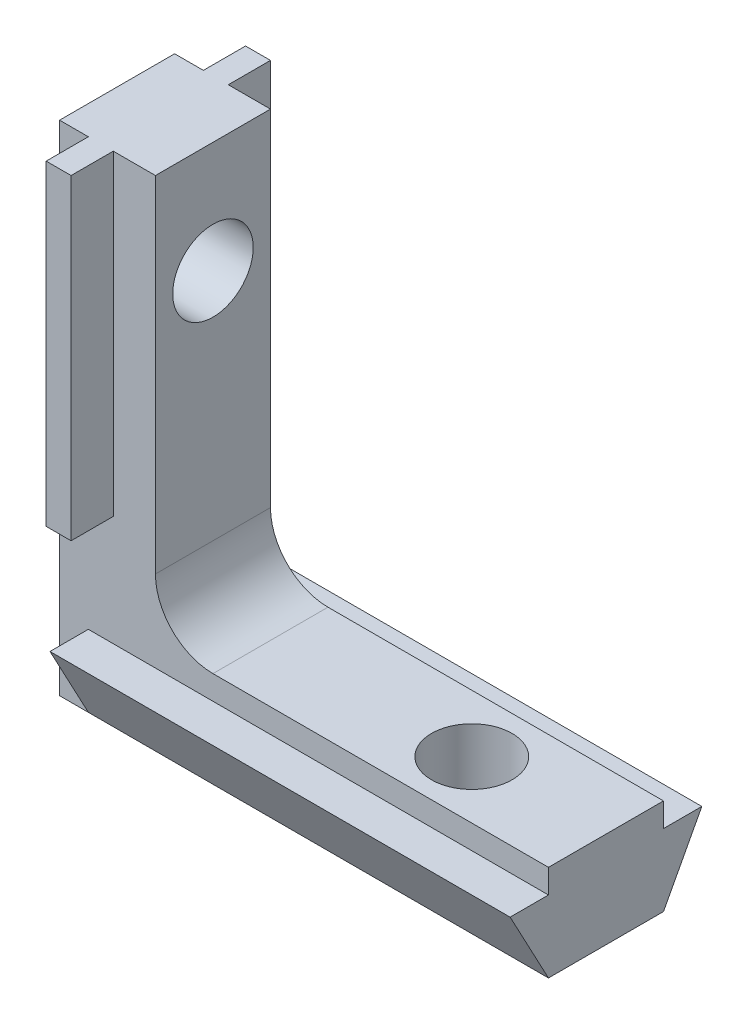
ISO-10303-21;
HEADER;
FILE_DESCRIPTION(('STEP AP214'),'2;1');
FILE_NAME('part.step','',(''),(''),'','','');
FILE_SCHEMA(('AUTOMOTIVE_DESIGN { 1 0 10303 214 1 1 1 1 }'));
ENDSEC;
DATA;
#1=APPLICATION_CONTEXT('core data for automotive mechanical design processes');
#2=APPLICATION_PROTOCOL_DEFINITION('international standard','automotive_design',2000,#1);
#3=PRODUCT_CONTEXT('',#1,'mechanical');
#4=PRODUCT('Part','Part','',(#3));
#5=PRODUCT_RELATED_PRODUCT_CATEGORY('part','',(#4));
#6=PRODUCT_DEFINITION_FORMATION('','',#4);
#7=PRODUCT_DEFINITION_CONTEXT('part definition',#1,'design');
#8=PRODUCT_DEFINITION('design','',#6,#7);
#9=PRODUCT_DEFINITION_SHAPE('','',#8);
#10=(LENGTH_UNIT() NAMED_UNIT(*) SI_UNIT(.MILLI.,.METRE.));
#11=(NAMED_UNIT(*) PLANE_ANGLE_UNIT() SI_UNIT($,.RADIAN.));
#12=(NAMED_UNIT(*) SI_UNIT($,.STERADIAN.) SOLID_ANGLE_UNIT());
#13=UNCERTAINTY_MEASURE_WITH_UNIT(LENGTH_MEASURE(1.E-05),#10,'distance_accuracy_value','');
#14=(GEOMETRIC_REPRESENTATION_CONTEXT(3) GLOBAL_UNCERTAINTY_ASSIGNED_CONTEXT((#13)) GLOBAL_UNIT_ASSIGNED_CONTEXT((#10,
#11,#12)) REPRESENTATION_CONTEXT('',''));
#15=CARTESIAN_POINT('',(0.,0.,0.));
#16=DIRECTION('',(0.,0.,1.));
#17=DIRECTION('',(1.,0.,0.));
#18=AXIS2_PLACEMENT_3D('',#15,#16,#17);
#19=CARTESIAN_POINT('',(0.,9.5,0.));
#20=DIRECTION('',(0.,1.,0.));
#21=DIRECTION('',(0.,0.,1.));
#22=AXIS2_PLACEMENT_3D('',#19,#20,#21);
#23=PLANE('',#22);
#24=DIRECTION('',(1.,0.,0.));
#25=VECTOR('',#24,1.);
#26=CARTESIAN_POINT('',(0.,9.5,3.));
#27=LINE('',#26,#25);
#28=CARTESIAN_POINT('',(2.8,9.5,3.));
#29=VERTEX_POINT('',#28);
#30=CARTESIAN_POINT('',(1.5,9.5,3.));
#31=VERTEX_POINT('',#30);
#32=EDGE_CURVE('E390',#29,#31,#27,.F.);
#33=ORIENTED_EDGE('',*,*,#32,.F.);
#34=DIRECTION('',(0.,0.,-1.));
#35=VECTOR('',#34,1.);
#36=CARTESIAN_POINT('',(2.8,9.5,-5.2));
#37=LINE('',#36,#35);
#38=CARTESIAN_POINT('',(2.8,9.5,5.2));
#39=VERTEX_POINT('',#38);
#40=EDGE_CURVE('E322',#39,#29,#37,.T.);
#41=ORIENTED_EDGE('',*,*,#40,.F.);
#42=DIRECTION('',(1.,0.,0.));
#43=VECTOR('',#42,1.);
#44=CARTESIAN_POINT('',(1.5,9.5,5.2));
#45=LINE('',#44,#43);
#46=CARTESIAN_POINT('',(1.5,9.5,5.2));
#47=VERTEX_POINT('',#46);
#48=EDGE_CURVE('E377',#47,#39,#45,.T.);
#49=ORIENTED_EDGE('',*,*,#48,.F.);
#50=DIRECTION('',(0.,0.,1.));
#51=VECTOR('',#50,1.);
#52=CARTESIAN_POINT('',(1.5,9.5,-5.2));
#53=LINE('',#52,#51);
#54=EDGE_CURVE('E321',#31,#47,#53,.T.);
#55=ORIENTED_EDGE('',*,*,#54,.F.);
#56=EDGE_LOOP('',(#33,#41,#49,#55));
#57=FACE_BOUND('',#56,.T.);
#58=ADVANCED_FACE('F15',(#57),#23,.F.);
#59=CARTESIAN_POINT('',(1.5,9.5,5.2));
#60=DIRECTION('',(0.,0.,1.));
#61=DIRECTION('',(1.,0.,0.));
#62=AXIS2_PLACEMENT_3D('',#59,#60,#61);
#63=PLANE('',#62);
#64=ORIENTED_EDGE('',*,*,#48,.T.);
#65=DIRECTION('',(0.,1.,0.));
#66=VECTOR('',#65,1.);
#67=CARTESIAN_POINT('',(2.8,9.5,5.2));
#68=LINE('',#67,#66);
#69=CARTESIAN_POINT('',(2.8,26.,5.2));
#70=VERTEX_POINT('',#69);
#71=EDGE_CURVE('E347',#70,#39,#68,.F.);
#72=ORIENTED_EDGE('',*,*,#71,.F.);
#73=DIRECTION('',(1.,0.,0.));
#74=VECTOR('',#73,1.);
#75=CARTESIAN_POINT('',(1.5,26.,5.2));
#76=LINE('',#75,#74);
#77=CARTESIAN_POINT('',(1.5,26.,5.2));
#78=VERTEX_POINT('',#77);
#79=EDGE_CURVE('E393',#70,#78,#76,.F.);
#80=ORIENTED_EDGE('',*,*,#79,.T.);
#81=DIRECTION('',(0.,1.,0.));
#82=VECTOR('',#81,1.);
#83=CARTESIAN_POINT('',(1.5,9.5,5.2));
#84=LINE('',#83,#82);
#85=EDGE_CURVE('E363',#47,#78,#84,.T.);
#86=ORIENTED_EDGE('',*,*,#85,.F.);
#87=EDGE_LOOP('',(#64,#72,#80,#86));
#88=FACE_BOUND('',#87,.T.);
#89=ADVANCED_FACE('F716',(#88),#63,.T.);
#90=CARTESIAN_POINT('',(0.,9.5,0.));
#91=DIRECTION('',(0.,1.,0.));
#92=DIRECTION('',(0.,0.,1.));
#93=AXIS2_PLACEMENT_3D('',#90,#91,#92);
#94=PLANE('',#93);
#95=DIRECTION('',(0.,0.,1.));
#96=VECTOR('',#95,1.);
#97=CARTESIAN_POINT('',(1.5,9.5,-5.2));
#98=LINE('',#97,#96);
#99=CARTESIAN_POINT('',(1.5,9.5,-5.2));
#100=VERTEX_POINT('',#99);
#101=CARTESIAN_POINT('',(1.5,9.5,-3.));
#102=VERTEX_POINT('',#101);
#103=EDGE_CURVE('E302',#100,#102,#98,.T.);
#104=ORIENTED_EDGE('',*,*,#103,.F.);
#105=DIRECTION('',(-1.,0.,0.));
#106=VECTOR('',#105,1.);
#107=CARTESIAN_POINT('',(1.5,9.5,-5.2));
#108=LINE('',#107,#106);
#109=CARTESIAN_POINT('',(2.8,9.5,-5.2));
#110=VERTEX_POINT('',#109);
#111=EDGE_CURVE('E358',#110,#100,#108,.T.);
#112=ORIENTED_EDGE('',*,*,#111,.F.);
#113=DIRECTION('',(0.,0.,-1.));
#114=VECTOR('',#113,1.);
#115=CARTESIAN_POINT('',(2.8,9.5,-5.2));
#116=LINE('',#115,#114);
#117=CARTESIAN_POINT('',(2.8,9.5,-3.));
#118=VERTEX_POINT('',#117);
#119=EDGE_CURVE('E293',#118,#110,#116,.T.);
#120=ORIENTED_EDGE('',*,*,#119,.F.);
#121=DIRECTION('',(1.,0.,0.));
#122=VECTOR('',#121,1.);
#123=CARTESIAN_POINT('',(0.,9.5,-3.));
#124=LINE('',#123,#122);
#125=EDGE_CURVE('E369',#102,#118,#124,.T.);
#126=ORIENTED_EDGE('',*,*,#125,.F.);
#127=EDGE_LOOP('',(#104,#112,#120,#126));
#128=FACE_BOUND('',#127,.T.);
#129=ADVANCED_FACE('F707',(#128),#94,.F.);
#130=CARTESIAN_POINT('',(1.5,9.5,-5.2));
#131=DIRECTION('',(0.,0.,-1.));
#132=DIRECTION('',(-1.,0.,0.));
#133=AXIS2_PLACEMENT_3D('',#130,#131,#132);
#134=PLANE('',#133);
#135=ORIENTED_EDGE('',*,*,#111,.T.);
#136=DIRECTION('',(0.,1.,0.));
#137=VECTOR('',#136,1.);
#138=CARTESIAN_POINT('',(1.5,9.5,-5.2));
#139=LINE('',#138,#137);
#140=CARTESIAN_POINT('',(1.5,26.,-5.2));
#141=VERTEX_POINT('',#140);
#142=EDGE_CURVE('E296',#141,#100,#139,.F.);
#143=ORIENTED_EDGE('',*,*,#142,.F.);
#144=DIRECTION('',(-1.,0.,0.));
#145=VECTOR('',#144,1.);
#146=CARTESIAN_POINT('',(1.5,26.,-5.2));
#147=LINE('',#146,#145);
#148=CARTESIAN_POINT('',(2.8,26.,-5.2));
#149=VERTEX_POINT('',#148);
#150=EDGE_CURVE('E366',#141,#149,#147,.F.);
#151=ORIENTED_EDGE('',*,*,#150,.T.);
#152=DIRECTION('',(0.,1.,0.));
#153=VECTOR('',#152,1.);
#154=CARTESIAN_POINT('',(2.8,9.5,-5.2));
#155=LINE('',#154,#153);
#156=EDGE_CURVE('E269',#110,#149,#155,.T.);
#157=ORIENTED_EDGE('',*,*,#156,.F.);
#158=EDGE_LOOP('',(#135,#143,#151,#157));
#159=FACE_BOUND('',#158,.T.);
#160=ADVANCED_FACE('F698',(#159),#134,.T.);
#161=CARTESIAN_POINT('',(2.8,9.5,-5.2));
#162=DIRECTION('',(1.,0.,0.));
#163=DIRECTION('',(0.,0.,-1.));
#164=AXIS2_PLACEMENT_3D('',#161,#162,#163);
#165=PLANE('',#164);
#166=ORIENTED_EDGE('',*,*,#71,.T.);
#167=ORIENTED_EDGE('',*,*,#40,.T.);
#168=DIRECTION('',(0.,1.,0.));
#169=VECTOR('',#168,1.);
#170=CARTESIAN_POINT('',(2.8,8.,3.));
#171=LINE('',#170,#169);
#172=CARTESIAN_POINT('',(2.8,26.,3.));
#173=VERTEX_POINT('',#172);
#174=EDGE_CURVE('E284',#29,#173,#171,.T.);
#175=ORIENTED_EDGE('',*,*,#174,.T.);
#176=DIRECTION('',(0.,0.,-1.));
#177=VECTOR('',#176,1.);
#178=CARTESIAN_POINT('',(2.8,26.,3.));
#179=LINE('',#178,#177);
#180=EDGE_CURVE('E244',#173,#70,#179,.F.);
#181=ORIENTED_EDGE('',*,*,#180,.T.);
#182=EDGE_LOOP('',(#166,#167,#175,#181));
#183=FACE_BOUND('',#182,.T.);
#184=ADVANCED_FACE('F690',(#183),#165,.T.);
#185=CARTESIAN_POINT('',(1.5,3.75,5.));
#186=DIRECTION('',(0.,1.,0.));
#187=DIRECTION('',(0.,0.,1.));
#188=AXIS2_PLACEMENT_3D('',#185,#186,#187);
#189=PLANE('',#188);
#190=DIRECTION('',(1.,0.,0.));
#191=VECTOR('',#190,1.);
#192=CARTESIAN_POINT('',(1.5,3.75,5.));
#193=LINE('',#192,#191);
#194=CARTESIAN_POINT('',(25.5,3.75,5.));
#195=VERTEX_POINT('',#194);
#196=CARTESIAN_POINT('',(1.49999999999999,3.75,5.));
#197=VERTEX_POINT('',#196);
#198=EDGE_CURVE('E303',#195,#197,#193,.F.);
#199=ORIENTED_EDGE('',*,*,#198,.F.);
#200=DIRECTION('',(0.,0.,1.));
#201=VECTOR('',#200,1.);
#202=CARTESIAN_POINT('',(25.5,3.75,3.));
#203=LINE('',#202,#201);
#204=CARTESIAN_POINT('',(25.5,3.75,3.));
#205=VERTEX_POINT('',#204);
#206=EDGE_CURVE('E313',#195,#205,#203,.F.);
#207=ORIENTED_EDGE('',*,*,#206,.T.);
#208=DIRECTION('',(-1.,0.,0.));
#209=VECTOR('',#208,1.);
#210=CARTESIAN_POINT('',(8.,3.75,3.));
#211=LINE('',#210,#209);
#212=CARTESIAN_POINT('',(1.49999999999999,3.75,3.));
#213=VERTEX_POINT('',#212);
#214=EDGE_CURVE('E325',#205,#213,#211,.T.);
#215=ORIENTED_EDGE('',*,*,#214,.T.);
#216=DIRECTION('',(0.,0.,-1.));
#217=VECTOR('',#216,1.);
#218=CARTESIAN_POINT('',(1.49999999999999,3.75,0.));
#219=LINE('',#218,#217);
#220=EDGE_CURVE('E317',#213,#197,#219,.F.);
#221=ORIENTED_EDGE('',*,*,#220,.T.);
#222=EDGE_LOOP('',(#199,#207,#215,#221));
#223=FACE_BOUND('',#222,.T.);
#224=ADVANCED_FACE('F491',(#223),#189,.T.);
#225=CARTESIAN_POINT('',(1.49999999999999,0.,0.));
#226=DIRECTION('',(1.,0.,0.));
#227=DIRECTION('',(0.,0.,-1.));
#228=AXIS2_PLACEMENT_3D('',#225,#226,#227);
#229=PLANE('',#228);
#230=DIRECTION('',(0.,1.,0.));
#231=VECTOR('',#230,1.);
#232=CARTESIAN_POINT('',(1.49999999999999,8.,3.));
#233=LINE('',#232,#231);
#234=CARTESIAN_POINT('',(1.49999999999999,0.,3.));
#235=VERTEX_POINT('',#234);
#236=EDGE_CURVE('E480',#213,#235,#233,.F.);
#237=ORIENTED_EDGE('',*,*,#236,.T.);
#238=DIRECTION('',(0.,-0.882352941176471,-0.470588235294118));
#239=VECTOR('',#238,1.);
#240=CARTESIAN_POINT('',(1.5,0.,3.));
#241=LINE('',#240,#239);
#242=EDGE_CURVE('E299',#197,#235,#241,.T.);
#243=ORIENTED_EDGE('',*,*,#242,.F.);
#244=ORIENTED_EDGE('',*,*,#220,.F.);
#245=EDGE_LOOP('',(#237,#243,#244));
#246=FACE_BOUND('',#245,.T.);
#247=ADVANCED_FACE('F673',(#246),#229,.F.);
#248=CARTESIAN_POINT('',(1.5,9.5,-5.2));
#249=DIRECTION('',(-1.,0.,0.));
#250=DIRECTION('',(0.,0.,1.));
#251=AXIS2_PLACEMENT_3D('',#248,#249,#250);
#252=PLANE('',#251);
#253=ORIENTED_EDGE('',*,*,#85,.T.);
#254=DIRECTION('',(0.,0.,-1.));
#255=VECTOR('',#254,1.);
#256=CARTESIAN_POINT('',(1.5,26.,3.));
#257=LINE('',#256,#255);
#258=CARTESIAN_POINT('',(1.5,26.,3.));
#259=VERTEX_POINT('',#258);
#260=EDGE_CURVE('E336',#78,#259,#257,.T.);
#261=ORIENTED_EDGE('',*,*,#260,.T.);
#262=DIRECTION('',(0.,1.,0.));
#263=VECTOR('',#262,1.);
#264=CARTESIAN_POINT('',(1.5,8.,3.));
#265=LINE('',#264,#263);
#266=EDGE_CURVE('E438',#259,#31,#265,.F.);
#267=ORIENTED_EDGE('',*,*,#266,.T.);
#268=ORIENTED_EDGE('',*,*,#54,.T.);
#269=EDGE_LOOP('',(#253,#261,#267,#268));
#270=FACE_BOUND('',#269,.T.);
#271=ADVANCED_FACE('F663',(#270),#252,.T.);
#272=CARTESIAN_POINT('',(18.5,5.,0.));
#273=DIRECTION('',(0.,1.,0.));
#274=DIRECTION('',(0.,0.,1.));
#275=AXIS2_PLACEMENT_3D('',#272,#273,#274);
#276=CYLINDRICAL_SURFACE('',#275,2.1);
#277=CARTESIAN_POINT('',(18.5,0.,0.));
#278=DIRECTION('',(0.,1.,0.));
#279=DIRECTION('',(0.,0.,1.));
#280=AXIS2_PLACEMENT_3D('',#277,#278,#279);
#281=CIRCLE('',#280,2.1);
#282=CARTESIAN_POINT('',(18.5,0.,2.1));
#283=VERTEX_POINT('',#282);
#284=EDGE_CURVE('E233',#283,#283,#281,.F.);
#285=ORIENTED_EDGE('',*,*,#284,.T.);
#286=EDGE_LOOP('',(#285));
#287=FACE_BOUND('',#286,.T.);
#288=CARTESIAN_POINT('',(18.5,5.,0.));
#289=DIRECTION('',(0.,1.,0.));
#290=DIRECTION('',(0.,0.,1.));
#291=AXIS2_PLACEMENT_3D('',#288,#289,#290);
#292=CIRCLE('',#291,2.1);
#293=CARTESIAN_POINT('',(18.5,5.,2.1));
#294=VERTEX_POINT('',#293);
#295=EDGE_CURVE('E18',#294,#294,#292,.T.);
#296=ORIENTED_EDGE('',*,*,#295,.T.);
#297=EDGE_LOOP('',(#296));
#298=FACE_BOUND('',#297,.T.);
#299=ADVANCED_FACE('F656',(#287,#298),#276,.F.);
#300=CARTESIAN_POINT('',(25.5,0.,3.));
#301=DIRECTION('',(-1.,0.,0.));
#302=DIRECTION('',(0.,0.,1.));
#303=AXIS2_PLACEMENT_3D('',#300,#301,#302);
#304=PLANE('',#303);
#305=ORIENTED_EDGE('',*,*,#206,.F.);
#306=DIRECTION('',(0.,-0.882352941176471,-0.470588235294118));
#307=VECTOR('',#306,1.);
#308=CARTESIAN_POINT('',(25.5,0.,3.));
#309=LINE('',#308,#307);
#310=CARTESIAN_POINT('',(25.5,0.,3.));
#311=VERTEX_POINT('',#310);
#312=EDGE_CURVE('E306',#311,#195,#309,.F.);
#313=ORIENTED_EDGE('',*,*,#312,.F.);
#314=DIRECTION('',(0.,0.,1.));
#315=VECTOR('',#314,1.);
#316=CARTESIAN_POINT('',(25.5,0.,3.));
#317=LINE('',#316,#315);
#318=CARTESIAN_POINT('',(25.5,0.,-3.));
#319=VERTEX_POINT('',#318);
#320=EDGE_CURVE('E473',#311,#319,#317,.F.);
#321=ORIENTED_EDGE('',*,*,#320,.T.);
#322=DIRECTION('',(0.,0.882352941176471,-0.470588235294118));
#323=VECTOR('',#322,1.);
#324=CARTESIAN_POINT('',(25.5,0.,-3.));
#325=LINE('',#324,#323);
#326=CARTESIAN_POINT('',(25.5,3.75,-5.));
#327=VERTEX_POINT('',#326);
#328=EDGE_CURVE('E310',#327,#319,#325,.F.);
#329=ORIENTED_EDGE('',*,*,#328,.F.);
#330=DIRECTION('',(0.,0.,1.));
#331=VECTOR('',#330,1.);
#332=CARTESIAN_POINT('',(25.5,3.75,5.));
#333=LINE('',#332,#331);
#334=CARTESIAN_POINT('',(25.5,3.75,-3.));
#335=VERTEX_POINT('',#334);
#336=EDGE_CURVE('E208',#335,#327,#333,.F.);
#337=ORIENTED_EDGE('',*,*,#336,.F.);
#338=DIRECTION('',(0.,1.,0.));
#339=VECTOR('',#338,1.);
#340=CARTESIAN_POINT('',(25.5,0.,-3.));
#341=LINE('',#340,#339);
#342=CARTESIAN_POINT('',(25.5,5.,-3.));
#343=VERTEX_POINT('',#342);
#344=EDGE_CURVE('E316',#343,#335,#341,.F.);
#345=ORIENTED_EDGE('',*,*,#344,.F.);
#346=DIRECTION('',(0.,0.,1.));
#347=VECTOR('',#346,1.);
#348=CARTESIAN_POINT('',(25.5,5.,3.));
#349=LINE('',#348,#347);
#350=CARTESIAN_POINT('',(25.5,5.,3.));
#351=VERTEX_POINT('',#350);
#352=EDGE_CURVE('E209',#343,#351,#349,.T.);
#353=ORIENTED_EDGE('',*,*,#352,.T.);
#354=DIRECTION('',(0.,1.,0.));
#355=VECTOR('',#354,1.);
#356=CARTESIAN_POINT('',(25.5,8.,3.));
#357=LINE('',#356,#355);
#358=EDGE_CURVE('E220',#351,#205,#357,.F.);
#359=ORIENTED_EDGE('',*,*,#358,.T.);
#360=EDGE_LOOP('',(#305,#313,#321,#329,#337,#345,#353,#359));
#361=FACE_BOUND('',#360,.T.);
#362=ADVANCED_FACE('F495',(#361),#304,.F.);
#363=CARTESIAN_POINT('',(1.5,0.,-3.));
#364=DIRECTION('',(0.,-0.470588235294118,-0.882352941176471));
#365=DIRECTION('',(0.,0.882352941176471,-0.470588235294118));
#366=AXIS2_PLACEMENT_3D('',#363,#364,#365);
#367=PLANE('',#366);
#368=DIRECTION('',(0.,0.882352941176471,-0.470588235294118));
#369=VECTOR('',#368,1.);
#370=CARTESIAN_POINT('',(1.49999999999999,0.,-3.));
#371=LINE('',#370,#369);
#372=CARTESIAN_POINT('',(1.5,0.,-3.));
#373=VERTEX_POINT('',#372);
#374=CARTESIAN_POINT('',(1.5,3.75,-5.));
#375=VERTEX_POINT('',#374);
#376=EDGE_CURVE('E248',#373,#375,#371,.T.);
#377=ORIENTED_EDGE('',*,*,#376,.T.);
#378=DIRECTION('',(1.,0.,0.));
#379=VECTOR('',#378,1.);
#380=CARTESIAN_POINT('',(1.5,3.75,-5.));
#381=LINE('',#380,#379);
#382=EDGE_CURVE('E257',#327,#375,#381,.F.);
#383=ORIENTED_EDGE('',*,*,#382,.F.);
#384=ORIENTED_EDGE('',*,*,#328,.T.);
#385=DIRECTION('',(1.,0.,0.));
#386=VECTOR('',#385,1.);
#387=CARTESIAN_POINT('',(0.,0.,-3.));
#388=LINE('',#387,#386);
#389=EDGE_CURVE('E469',#319,#373,#388,.F.);
#390=ORIENTED_EDGE('',*,*,#389,.T.);
#391=EDGE_LOOP('',(#377,#383,#384,#390));
#392=FACE_BOUND('',#391,.T.);
#393=ADVANCED_FACE('F639',(#392),#367,.T.);
#394=CARTESIAN_POINT('',(1.5,0.,3.));
#395=DIRECTION('',(0.,-0.470588235294118,0.882352941176471));
#396=DIRECTION('',(0.,-0.882352941176471,-0.470588235294118));
#397=AXIS2_PLACEMENT_3D('',#394,#395,#396);
#398=PLANE('',#397);
#399=ORIENTED_EDGE('',*,*,#242,.T.);
#400=DIRECTION('',(1.,0.,0.));
#401=VECTOR('',#400,1.);
#402=CARTESIAN_POINT('',(0.,0.,3.));
#403=LINE('',#402,#401);
#404=EDGE_CURVE('E422',#235,#311,#403,.T.);
#405=ORIENTED_EDGE('',*,*,#404,.T.);
#406=ORIENTED_EDGE('',*,*,#312,.T.);
#407=ORIENTED_EDGE('',*,*,#198,.T.);
#408=EDGE_LOOP('',(#399,#405,#406,#407));
#409=FACE_BOUND('',#408,.T.);
#410=ADVANCED_FACE('F630',(#409),#398,.T.);
#411=CARTESIAN_POINT('',(1.5,9.5,-5.2));
#412=DIRECTION('',(-1.,0.,0.));
#413=DIRECTION('',(0.,0.,1.));
#414=AXIS2_PLACEMENT_3D('',#411,#412,#413);
#415=PLANE('',#414);
#416=DIRECTION('',(0.,0.,-1.));
#417=VECTOR('',#416,1.);
#418=CARTESIAN_POINT('',(1.5,26.,3.));
#419=LINE('',#418,#417);
#420=CARTESIAN_POINT('',(1.5,26.,-3.));
#421=VERTEX_POINT('',#420);
#422=EDGE_CURVE('E285',#421,#141,#419,.T.);
#423=ORIENTED_EDGE('',*,*,#422,.T.);
#424=ORIENTED_EDGE('',*,*,#142,.T.);
#425=ORIENTED_EDGE('',*,*,#103,.T.);
#426=DIRECTION('',(0.,1.,0.));
#427=VECTOR('',#426,1.);
#428=CARTESIAN_POINT('',(1.5,8.,-3.));
#429=LINE('',#428,#427);
#430=EDGE_CURVE('E290',#421,#102,#429,.F.);
#431=ORIENTED_EDGE('',*,*,#430,.F.);
#432=EDGE_LOOP('',(#423,#424,#425,#431));
#433=FACE_BOUND('',#432,.T.);
#434=ADVANCED_FACE('F621',(#433),#415,.T.);
#435=CARTESIAN_POINT('',(2.8,9.5,-5.2));
#436=DIRECTION('',(1.,0.,0.));
#437=DIRECTION('',(0.,0.,-1.));
#438=AXIS2_PLACEMENT_3D('',#435,#436,#437);
#439=PLANE('',#438);
#440=ORIENTED_EDGE('',*,*,#119,.T.);
#441=ORIENTED_EDGE('',*,*,#156,.T.);
#442=DIRECTION('',(0.,0.,-1.));
#443=VECTOR('',#442,1.);
#444=CARTESIAN_POINT('',(2.8,26.,3.));
#445=LINE('',#444,#443);
#446=CARTESIAN_POINT('',(2.8,26.,-3.));
#447=VERTEX_POINT('',#446);
#448=EDGE_CURVE('E280',#149,#447,#445,.F.);
#449=ORIENTED_EDGE('',*,*,#448,.T.);
#450=DIRECTION('',(0.,1.,0.));
#451=VECTOR('',#450,1.);
#452=CARTESIAN_POINT('',(2.8,8.,-3.));
#453=LINE('',#452,#451);
#454=EDGE_CURVE('E275',#118,#447,#453,.T.);
#455=ORIENTED_EDGE('',*,*,#454,.F.);
#456=EDGE_LOOP('',(#440,#441,#449,#455));
#457=FACE_BOUND('',#456,.T.);
#458=ADVANCED_FACE('F612',(#457),#439,.T.);
#459=CARTESIAN_POINT('',(5.,8.00000000000002,3.));
#460=DIRECTION('',(-1.,0.,0.));
#461=DIRECTION('',(0.,-1.,0.));
#462=AXIS2_PLACEMENT_3D('',#459,#460,#461);
#463=PLANE('',#462);
#464=DIRECTION('',(0.,0.,-1.));
#465=VECTOR('',#464,1.);
#466=CARTESIAN_POINT('',(5.,26.,3.));
#467=LINE('',#466,#465);
#468=CARTESIAN_POINT('',(5.,26.,-3.));
#469=VERTEX_POINT('',#468);
#470=CARTESIAN_POINT('',(5.,26.,3.));
#471=VERTEX_POINT('',#470);
#472=EDGE_CURVE('E238',#469,#471,#467,.F.);
#473=ORIENTED_EDGE('',*,*,#472,.T.);
#474=DIRECTION('',(0.,1.,0.));
#475=VECTOR('',#474,1.);
#476=CARTESIAN_POINT('',(5.,8.,3.));
#477=LINE('',#476,#475);
#478=CARTESIAN_POINT('',(5.,8.,3.));
#479=VERTEX_POINT('',#478);
#480=EDGE_CURVE('E225',#471,#479,#477,.F.);
#481=ORIENTED_EDGE('',*,*,#480,.T.);
#482=DIRECTION('',(0.,0.,-1.));
#483=VECTOR('',#482,1.);
#484=CARTESIAN_POINT('',(5.,8.,3.));
#485=LINE('',#484,#483);
#486=CARTESIAN_POINT('',(5.,8.,-3.));
#487=VERTEX_POINT('',#486);
#488=EDGE_CURVE('E191',#479,#487,#485,.T.);
#489=ORIENTED_EDGE('',*,*,#488,.T.);
#490=DIRECTION('',(0.,1.,0.));
#491=VECTOR('',#490,1.);
#492=CARTESIAN_POINT('',(5.,8.,-3.));
#493=LINE('',#492,#491);
#494=EDGE_CURVE('E274',#469,#487,#493,.F.);
#495=ORIENTED_EDGE('',*,*,#494,.F.);
#496=EDGE_LOOP('',(#473,#481,#489,#495));
#497=FACE_BOUND('',#496,.T.);
#498=CARTESIAN_POINT('',(5.,20.2,0.));
#499=DIRECTION('',(1.,0.,0.));
#500=DIRECTION('',(0.,0.,-1.));
#501=AXIS2_PLACEMENT_3D('',#498,#499,#500);
#502=CIRCLE('',#501,2.09999999999999);
#503=CARTESIAN_POINT('',(5.,20.2,-2.1));
#504=VERTEX_POINT('',#503);
#505=EDGE_CURVE('E235',#504,#504,#502,.F.);
#506=ORIENTED_EDGE('',*,*,#505,.T.);
#507=EDGE_LOOP('',(#506));
#508=FACE_BOUND('',#507,.T.);
#509=ADVANCED_FACE('F604',(#497,#508),#463,.F.);
#510=CARTESIAN_POINT('',(8.,8.,3.));
#511=DIRECTION('',(0.,0.,-1.));
#512=DIRECTION('',(-1.,0.,0.));
#513=AXIS2_PLACEMENT_3D('',#510,#511,#512);
#514=CYLINDRICAL_SURFACE('',#513,3.);
#515=ORIENTED_EDGE('',*,*,#488,.F.);
#516=CARTESIAN_POINT('',(8.,8.,3.));
#517=DIRECTION('',(0.,0.,-1.));
#518=DIRECTION('',(-1.,0.,0.));
#519=AXIS2_PLACEMENT_3D('',#516,#517,#518);
#520=CIRCLE('',#519,3.);
#521=CARTESIAN_POINT('',(8.00000000000001,5.,3.));
#522=VERTEX_POINT('',#521);
#523=EDGE_CURVE('E216',#479,#522,#520,.F.);
#524=ORIENTED_EDGE('',*,*,#523,.T.);
#525=DIRECTION('',(0.,0.,1.));
#526=VECTOR('',#525,1.);
#527=CARTESIAN_POINT('',(8.00000000000002,5.,3.));
#528=LINE('',#527,#526);
#529=CARTESIAN_POINT('',(8.00000000000001,5.,-3.));
#530=VERTEX_POINT('',#529);
#531=EDGE_CURVE('E199',#522,#530,#528,.F.);
#532=ORIENTED_EDGE('',*,*,#531,.T.);
#533=CARTESIAN_POINT('',(8.,8.,-3.));
#534=DIRECTION('',(0.,0.,-1.));
#535=DIRECTION('',(-1.,0.,0.));
#536=AXIS2_PLACEMENT_3D('',#533,#534,#535);
#537=CIRCLE('',#536,3.);
#538=EDGE_CURVE('E449',#487,#530,#537,.F.);
#539=ORIENTED_EDGE('',*,*,#538,.F.);
#540=EDGE_LOOP('',(#515,#524,#532,#539));
#541=FACE_BOUND('',#540,.T.);
#542=ADVANCED_FACE('F223',(#541),#514,.F.);
#543=CARTESIAN_POINT('',(25.5,5.,3.));
#544=DIRECTION('',(0.,-1.,0.));
#545=DIRECTION('',(1.,0.,0.));
#546=AXIS2_PLACEMENT_3D('',#543,#544,#545);
#547=PLANE('',#546);
#548=ORIENTED_EDGE('',*,*,#531,.F.);
#549=DIRECTION('',(-1.,0.,0.));
#550=VECTOR('',#549,1.);
#551=CARTESIAN_POINT('',(8.,5.,3.));
#552=LINE('',#551,#550);
#553=EDGE_CURVE('E204',#522,#351,#552,.F.);
#554=ORIENTED_EDGE('',*,*,#553,.T.);
#555=ORIENTED_EDGE('',*,*,#352,.F.);
#556=DIRECTION('',(-1.,0.,0.));
#557=VECTOR('',#556,1.);
#558=CARTESIAN_POINT('',(8.,5.,-3.));
#559=LINE('',#558,#557);
#560=EDGE_CURVE('E206',#530,#343,#559,.F.);
#561=ORIENTED_EDGE('',*,*,#560,.F.);
#562=EDGE_LOOP('',(#548,#554,#555,#561));
#563=FACE_BOUND('',#562,.T.);
#564=ORIENTED_EDGE('',*,*,#295,.F.);
#565=EDGE_LOOP('',(#564));
#566=FACE_BOUND('',#565,.T.);
#567=ADVANCED_FACE('F201',(#563,#566),#547,.F.);
#568=CARTESIAN_POINT('',(1.5,3.75,5.));
#569=DIRECTION('',(0.,1.,0.));
#570=DIRECTION('',(0.,0.,1.));
#571=AXIS2_PLACEMENT_3D('',#568,#569,#570);
#572=PLANE('',#571);
#573=ORIENTED_EDGE('',*,*,#336,.T.);
#574=ORIENTED_EDGE('',*,*,#382,.T.);
#575=DIRECTION('',(0.,0.,-1.));
#576=VECTOR('',#575,1.);
#577=CARTESIAN_POINT('',(1.49999999999999,3.75,0.));
#578=LINE('',#577,#576);
#579=CARTESIAN_POINT('',(1.5,3.75,-3.));
#580=VERTEX_POINT('',#579);
#581=EDGE_CURVE('E239',#375,#580,#578,.F.);
#582=ORIENTED_EDGE('',*,*,#581,.T.);
#583=DIRECTION('',(-1.,0.,0.));
#584=VECTOR('',#583,1.);
#585=CARTESIAN_POINT('',(8.,3.75,-3.));
#586=LINE('',#585,#584);
#587=EDGE_CURVE('E384',#335,#580,#586,.T.);
#588=ORIENTED_EDGE('',*,*,#587,.F.);
#589=EDGE_LOOP('',(#573,#574,#582,#588));
#590=FACE_BOUND('',#589,.T.);
#591=ADVANCED_FACE('F501',(#590),#572,.T.);
#592=CARTESIAN_POINT('',(1.49999999999999,0.,0.));
#593=DIRECTION('',(1.,0.,0.));
#594=DIRECTION('',(0.,0.,-1.));
#595=AXIS2_PLACEMENT_3D('',#592,#593,#594);
#596=PLANE('',#595);
#597=ORIENTED_EDGE('',*,*,#581,.F.);
#598=ORIENTED_EDGE('',*,*,#376,.F.);
#599=DIRECTION('',(0.,1.,0.));
#600=VECTOR('',#599,1.);
#601=CARTESIAN_POINT('',(1.5,8.,-3.));
#602=LINE('',#601,#600);
#603=EDGE_CURVE('E387',#580,#373,#602,.F.);
#604=ORIENTED_EDGE('',*,*,#603,.F.);
#605=EDGE_LOOP('',(#597,#598,#604));
#606=FACE_BOUND('',#605,.T.);
#607=ADVANCED_FACE('F503',(#606),#596,.F.);
#608=CARTESIAN_POINT('',(5.,20.2,0.));
#609=DIRECTION('',(1.,0.,0.));
#610=DIRECTION('',(0.,0.,-1.));
#611=AXIS2_PLACEMENT_3D('',#608,#609,#610);
#612=CYLINDRICAL_SURFACE('',#611,2.09999999999999);
#613=CARTESIAN_POINT('',(0.,20.2,0.));
#614=DIRECTION('',(1.,0.,0.));
#615=DIRECTION('',(0.,0.,-1.));
#616=AXIS2_PLACEMENT_3D('',#613,#614,#615);
#617=CIRCLE('',#616,2.09999999999999);
#618=CARTESIAN_POINT('',(0.,20.2,-2.1));
#619=VERTEX_POINT('',#618);
#620=EDGE_CURVE('E445',#619,#619,#617,.F.);
#621=ORIENTED_EDGE('',*,*,#620,.T.);
#622=EDGE_LOOP('',(#621));
#623=FACE_BOUND('',#622,.T.);
#624=ORIENTED_EDGE('',*,*,#505,.F.);
#625=EDGE_LOOP('',(#624));
#626=FACE_BOUND('',#625,.T.);
#627=ADVANCED_FACE('F510',(#623,#626),#612,.F.);
#628=CARTESIAN_POINT('',(5.,26.,3.));
#629=DIRECTION('',(0.,-1.,0.));
#630=DIRECTION('',(0.,0.,-1.));
#631=AXIS2_PLACEMENT_3D('',#628,#629,#630);
#632=PLANE('',#631);
#633=ORIENTED_EDGE('',*,*,#448,.F.);
#634=ORIENTED_EDGE('',*,*,#150,.F.);
#635=ORIENTED_EDGE('',*,*,#422,.F.);
#636=DIRECTION('',(-1.,0.,0.));
#637=VECTOR('',#636,1.);
#638=CARTESIAN_POINT('',(8.,26.,-3.));
#639=LINE('',#638,#637);
#640=CARTESIAN_POINT('',(0.,26.,-3.));
#641=VERTEX_POINT('',#640);
#642=EDGE_CURVE('E448',#641,#421,#639,.F.);
#643=ORIENTED_EDGE('',*,*,#642,.F.);
#644=DIRECTION('',(0.,0.,1.));
#645=VECTOR('',#644,1.);
#646=CARTESIAN_POINT('',(0.,26.,3.));
#647=LINE('',#646,#645);
#648=CARTESIAN_POINT('',(0.,26.,3.));
#649=VERTEX_POINT('',#648);
#650=EDGE_CURVE('E447',#641,#649,#647,.T.);
#651=ORIENTED_EDGE('',*,*,#650,.T.);
#652=DIRECTION('',(-1.,0.,0.));
#653=VECTOR('',#652,1.);
#654=CARTESIAN_POINT('',(8.,26.,3.));
#655=LINE('',#654,#653);
#656=EDGE_CURVE('E442',#649,#259,#655,.F.);
#657=ORIENTED_EDGE('',*,*,#656,.T.);
#658=ORIENTED_EDGE('',*,*,#260,.F.);
#659=ORIENTED_EDGE('',*,*,#79,.F.);
#660=ORIENTED_EDGE('',*,*,#180,.F.);
#661=DIRECTION('',(-1.,0.,0.));
#662=VECTOR('',#661,1.);
#663=CARTESIAN_POINT('',(8.,26.,3.));
#664=LINE('',#663,#662);
#665=EDGE_CURVE('E230',#173,#471,#664,.F.);
#666=ORIENTED_EDGE('',*,*,#665,.T.);
#667=ORIENTED_EDGE('',*,*,#472,.F.);
#668=DIRECTION('',(-1.,0.,0.));
#669=VECTOR('',#668,1.);
#670=CARTESIAN_POINT('',(8.,26.,-3.));
#671=LINE('',#670,#669);
#672=EDGE_CURVE('E270',#447,#469,#671,.F.);
#673=ORIENTED_EDGE('',*,*,#672,.F.);
#674=EDGE_LOOP('',(#633,#634,#635,#643,#651,#657,#658,#659,#660,#666,#667,#673));
#675=FACE_BOUND('',#674,.T.);
#676=ADVANCED_FACE('F532',(#675),#632,.F.);
#677=CARTESIAN_POINT('',(8.,8.,3.));
#678=DIRECTION('',(0.,0.,-1.));
#679=DIRECTION('',(-1.,0.,0.));
#680=AXIS2_PLACEMENT_3D('',#677,#678,#679);
#681=PLANE('',#680);
#682=ORIENTED_EDGE('',*,*,#266,.F.);
#683=ORIENTED_EDGE('',*,*,#656,.F.);
#684=DIRECTION('',(0.,1.,0.));
#685=VECTOR('',#684,1.);
#686=CARTESIAN_POINT('',(0.,26.,3.));
#687=LINE('',#686,#685);
#688=CARTESIAN_POINT('',(0.,0.,3.));
#689=VERTEX_POINT('',#688);
#690=EDGE_CURVE('E774',#649,#689,#687,.F.);
#691=ORIENTED_EDGE('',*,*,#690,.T.);
#692=DIRECTION('',(1.,0.,0.));
#693=VECTOR('',#692,1.);
#694=CARTESIAN_POINT('',(0.,0.,3.));
#695=LINE('',#694,#693);
#696=EDGE_CURVE('E465',#689,#235,#695,.T.);
#697=ORIENTED_EDGE('',*,*,#696,.T.);
#698=ORIENTED_EDGE('',*,*,#236,.F.);
#699=ORIENTED_EDGE('',*,*,#214,.F.);
#700=ORIENTED_EDGE('',*,*,#358,.F.);
#701=ORIENTED_EDGE('',*,*,#553,.F.);
#702=ORIENTED_EDGE('',*,*,#523,.F.);
#703=ORIENTED_EDGE('',*,*,#480,.F.);
#704=ORIENTED_EDGE('',*,*,#665,.F.);
#705=ORIENTED_EDGE('',*,*,#174,.F.);
#706=ORIENTED_EDGE('',*,*,#32,.T.);
#707=EDGE_LOOP('',(#682,#683,#691,#697,#698,#699,#700,#701,#702,#703,#704,#705,#706));
#708=FACE_BOUND('',#707,.T.);
#709=ADVANCED_FACE('F214',(#708),#681,.F.);
#710=CARTESIAN_POINT('',(0.,0.,3.));
#711=DIRECTION('',(0.,1.,0.));
#712=DIRECTION('',(0.,0.,1.));
#713=AXIS2_PLACEMENT_3D('',#710,#711,#712);
#714=PLANE('',#713);
#715=ORIENTED_EDGE('',*,*,#696,.F.);
#716=DIRECTION('',(0.,0.,1.));
#717=VECTOR('',#716,1.);
#718=CARTESIAN_POINT('',(0.,0.,3.));
#719=LINE('',#718,#717);
#720=CARTESIAN_POINT('',(0.,0.,-3.));
#721=VERTEX_POINT('',#720);
#722=EDGE_CURVE('E25',#689,#721,#719,.F.);
#723=ORIENTED_EDGE('',*,*,#722,.T.);
#724=DIRECTION('',(-1.,0.,0.));
#725=VECTOR('',#724,1.);
#726=CARTESIAN_POINT('',(8.,0.,-3.));
#727=LINE('',#726,#725);
#728=EDGE_CURVE('E37',#373,#721,#727,.T.);
#729=ORIENTED_EDGE('',*,*,#728,.F.);
#730=ORIENTED_EDGE('',*,*,#389,.F.);
#731=ORIENTED_EDGE('',*,*,#320,.F.);
#732=ORIENTED_EDGE('',*,*,#404,.F.);
#733=EDGE_LOOP('',(#715,#723,#729,#730,#731,#732));
#734=FACE_BOUND('',#733,.T.);
#735=ORIENTED_EDGE('',*,*,#284,.F.);
#736=EDGE_LOOP('',(#735));
#737=FACE_BOUND('',#736,.T.);
#738=ADVANCED_FACE('F523',(#734,#737),#714,.F.);
#739=CARTESIAN_POINT('',(8.,8.,-3.));
#740=DIRECTION('',(0.,0.,-1.));
#741=DIRECTION('',(-1.,0.,0.));
#742=AXIS2_PLACEMENT_3D('',#739,#740,#741);
#743=PLANE('',#742);
#744=DIRECTION('',(0.,1.,0.));
#745=VECTOR('',#744,1.);
#746=CARTESIAN_POINT('',(0.,26.,-3.));
#747=LINE('',#746,#745);
#748=EDGE_CURVE('E10',#721,#641,#747,.T.);
#749=ORIENTED_EDGE('',*,*,#748,.T.);
#750=ORIENTED_EDGE('',*,*,#642,.T.);
#751=ORIENTED_EDGE('',*,*,#430,.T.);
#752=ORIENTED_EDGE('',*,*,#125,.T.);
#753=ORIENTED_EDGE('',*,*,#454,.T.);
#754=ORIENTED_EDGE('',*,*,#672,.T.);
#755=ORIENTED_EDGE('',*,*,#494,.T.);
#756=ORIENTED_EDGE('',*,*,#538,.T.);
#757=ORIENTED_EDGE('',*,*,#560,.T.);
#758=ORIENTED_EDGE('',*,*,#344,.T.);
#759=ORIENTED_EDGE('',*,*,#587,.T.);
#760=ORIENTED_EDGE('',*,*,#603,.T.);
#761=ORIENTED_EDGE('',*,*,#728,.T.);
#762=EDGE_LOOP('',(#749,#750,#751,#752,#753,#754,#755,#756,#757,#758,#759,#760,#761));
#763=FACE_BOUND('',#762,.T.);
#764=ADVANCED_FACE('F498',(#763),#743,.T.);
#765=CARTESIAN_POINT('',(0.,26.,3.));
#766=DIRECTION('',(1.,0.,0.));
#767=DIRECTION('',(0.,1.,0.));
#768=AXIS2_PLACEMENT_3D('',#765,#766,#767);
#769=PLANE('',#768);
#770=ORIENTED_EDGE('',*,*,#722,.F.);
#771=ORIENTED_EDGE('',*,*,#690,.F.);
#772=ORIENTED_EDGE('',*,*,#650,.F.);
#773=ORIENTED_EDGE('',*,*,#748,.F.);
#774=EDGE_LOOP('',(#770,#771,#772,#773));
#775=FACE_BOUND('',#774,.T.);
#776=ORIENTED_EDGE('',*,*,#620,.F.);
#777=EDGE_LOOP('',(#776));
#778=FACE_BOUND('',#777,.T.);
#779=ADVANCED_FACE('F515',(#775,#778),#769,.F.);
#780=CLOSED_SHELL('',(#58,#89,#129,#160,#184,#224,#247,#271,#299,#362,#393,#410,#434,#458,#509,
#542,#567,#591,#607,#627,#676,#709,#738,#764,#779));
#781=MANIFOLD_SOLID_BREP('B1',#780);
#782=ADVANCED_BREP_SHAPE_REPRESENTATION('',(#18,#781),#14);
#783=SHAPE_DEFINITION_REPRESENTATION(#9,#782);
ENDSEC;
END-ISO-10303-21;
